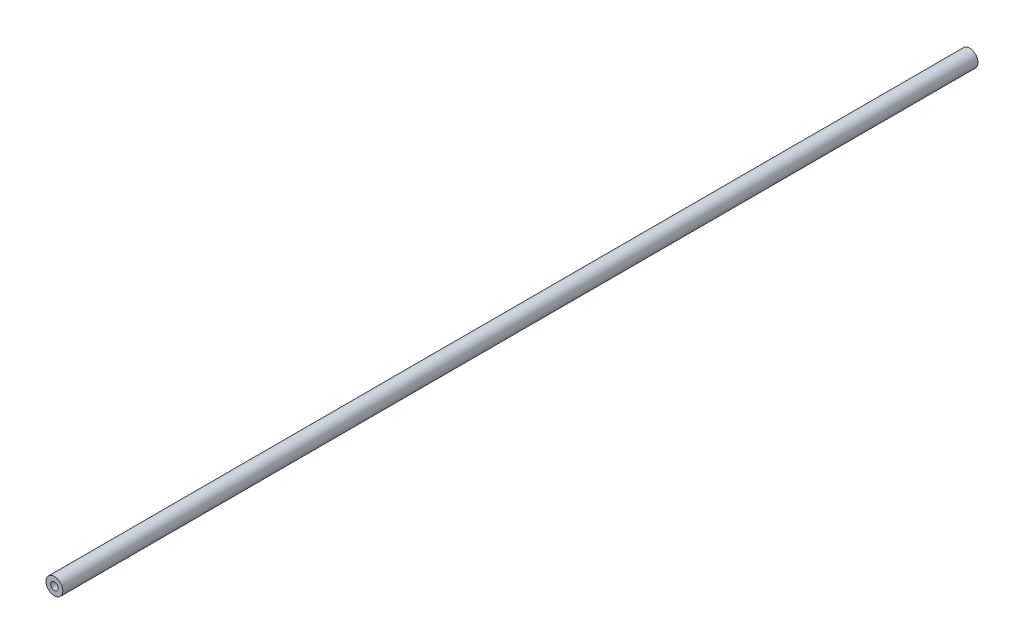
ISO-10303-21;
HEADER;
FILE_DESCRIPTION(('STEP AP214'),'2;1');
FILE_NAME('part.step','',(''),(''),'','','');
FILE_SCHEMA(('AUTOMOTIVE_DESIGN { 1 0 10303 214 1 1 1 1 }'));
ENDSEC;
DATA;
#1=APPLICATION_CONTEXT('core data for automotive mechanical design processes');
#2=APPLICATION_PROTOCOL_DEFINITION('international standard','automotive_design',2000,#1);
#3=PRODUCT_CONTEXT('',#1,'mechanical');
#4=PRODUCT('Part','Part','',(#3));
#5=PRODUCT_RELATED_PRODUCT_CATEGORY('part','',(#4));
#6=PRODUCT_DEFINITION_FORMATION('','',#4);
#7=PRODUCT_DEFINITION_CONTEXT('part definition',#1,'design');
#8=PRODUCT_DEFINITION('design','',#6,#7);
#9=PRODUCT_DEFINITION_SHAPE('','',#8);
#10=(LENGTH_UNIT() NAMED_UNIT(*) SI_UNIT(.MILLI.,.METRE.));
#11=(NAMED_UNIT(*) PLANE_ANGLE_UNIT() SI_UNIT($,.RADIAN.));
#12=(NAMED_UNIT(*) SI_UNIT($,.STERADIAN.) SOLID_ANGLE_UNIT());
#13=UNCERTAINTY_MEASURE_WITH_UNIT(LENGTH_MEASURE(1.E-05),#10,'distance_accuracy_value','');
#14=(GEOMETRIC_REPRESENTATION_CONTEXT(3) GLOBAL_UNCERTAINTY_ASSIGNED_CONTEXT((#13)) GLOBAL_UNIT_ASSIGNED_CONTEXT((#10,
#11,#12)) REPRESENTATION_CONTEXT('',''));
#15=CARTESIAN_POINT('',(0.,0.,0.));
#16=DIRECTION('',(0.,0.,1.));
#17=DIRECTION('',(1.,0.,0.));
#18=AXIS2_PLACEMENT_3D('',#15,#16,#17);
#19=CARTESIAN_POINT('',(0.,0.,490.));
#20=DIRECTION('',(0.,0.,1.));
#21=DIRECTION('',(1.,0.,0.));
#22=AXIS2_PLACEMENT_3D('',#19,#20,#21);
#23=PLANE('',#22);
#24=CARTESIAN_POINT('',(0.,0.,490.));
#25=DIRECTION('',(0.,0.,1.));
#26=DIRECTION('',(1.,0.,0.));
#27=AXIS2_PLACEMENT_3D('',#24,#25,#26);
#28=CIRCLE('',#27,4.5);
#29=CARTESIAN_POINT('',(4.5,0.,490.));
#30=VERTEX_POINT('',#29);
#31=EDGE_CURVE('E10',#30,#30,#28,.T.);
#32=ORIENTED_EDGE('',*,*,#31,.T.);
#33=EDGE_LOOP('',(#32));
#34=FACE_BOUND('',#33,.T.);
#35=CARTESIAN_POINT('',(0.,0.,490.));
#36=DIRECTION('',(0.,0.,1.));
#37=DIRECTION('',(1.,0.,0.));
#38=AXIS2_PLACEMENT_3D('',#35,#36,#37);
#39=CIRCLE('',#38,2.);
#40=CARTESIAN_POINT('',(2.,0.,490.));
#41=VERTEX_POINT('',#40);
#42=EDGE_CURVE('E43',#41,#41,#39,.T.);
#43=ORIENTED_EDGE('',*,*,#42,.F.);
#44=EDGE_LOOP('',(#43));
#45=FACE_BOUND('',#44,.T.);
#46=ADVANCED_FACE('F32',(#34,#45),#23,.T.);
#47=CARTESIAN_POINT('',(0.,0.,0.));
#48=DIRECTION('',(0.,0.,1.));
#49=DIRECTION('',(1.,0.,0.));
#50=AXIS2_PLACEMENT_3D('',#47,#48,#49);
#51=PLANE('',#50);
#52=CARTESIAN_POINT('',(0.,0.,0.));
#53=DIRECTION('',(0.,0.,1.));
#54=DIRECTION('',(1.,0.,0.));
#55=AXIS2_PLACEMENT_3D('',#52,#53,#54);
#56=CIRCLE('',#55,4.5);
#57=CARTESIAN_POINT('',(4.5,0.,0.));
#58=VERTEX_POINT('',#57);
#59=EDGE_CURVE('E36',#58,#58,#56,.T.);
#60=ORIENTED_EDGE('',*,*,#59,.F.);
#61=EDGE_LOOP('',(#60));
#62=FACE_BOUND('',#61,.T.);
#63=CARTESIAN_POINT('',(0.,0.,0.));
#64=DIRECTION('',(0.,0.,1.));
#65=DIRECTION('',(1.,0.,0.));
#66=AXIS2_PLACEMENT_3D('',#63,#64,#65);
#67=CIRCLE('',#66,2.);
#68=CARTESIAN_POINT('',(2.,0.,0.));
#69=VERTEX_POINT('',#68);
#70=EDGE_CURVE('E45',#69,#69,#67,.T.);
#71=ORIENTED_EDGE('',*,*,#70,.T.);
#72=EDGE_LOOP('',(#71));
#73=FACE_BOUND('',#72,.T.);
#74=ADVANCED_FACE('F55',(#62,#73),#51,.F.);
#75=CARTESIAN_POINT('',(0.,0.,490.));
#76=DIRECTION('',(0.,0.,-1.));
#77=DIRECTION('',(-1.,0.,0.));
#78=AXIS2_PLACEMENT_3D('',#75,#76,#77);
#79=CYLINDRICAL_SURFACE('',#78,4.5);
#80=ORIENTED_EDGE('',*,*,#31,.F.);
#81=EDGE_LOOP('',(#80));
#82=FACE_BOUND('',#81,.T.);
#83=ORIENTED_EDGE('',*,*,#59,.T.);
#84=EDGE_LOOP('',(#83));
#85=FACE_BOUND('',#84,.T.);
#86=ADVANCED_FACE('F34',(#82,#85),#79,.T.);
#87=CARTESIAN_POINT('',(0.,0.,490.));
#88=DIRECTION('',(0.,0.,-1.));
#89=DIRECTION('',(-1.,0.,0.));
#90=AXIS2_PLACEMENT_3D('',#87,#88,#89);
#91=CYLINDRICAL_SURFACE('',#90,2.);
#92=ORIENTED_EDGE('',*,*,#42,.T.);
#93=EDGE_LOOP('',(#92));
#94=FACE_BOUND('',#93,.T.);
#95=ORIENTED_EDGE('',*,*,#70,.F.);
#96=EDGE_LOOP('',(#95));
#97=FACE_BOUND('',#96,.T.);
#98=ADVANCED_FACE('F51',(#94,#97),#91,.F.);
#99=CLOSED_SHELL('',(#46,#74,#86,#98));
#100=MANIFOLD_SOLID_BREP('B2',#99);
#101=ADVANCED_BREP_SHAPE_REPRESENTATION('',(#18,#100),#14);
#102=SHAPE_DEFINITION_REPRESENTATION(#9,#101);
ENDSEC;
END-ISO-10303-21;
